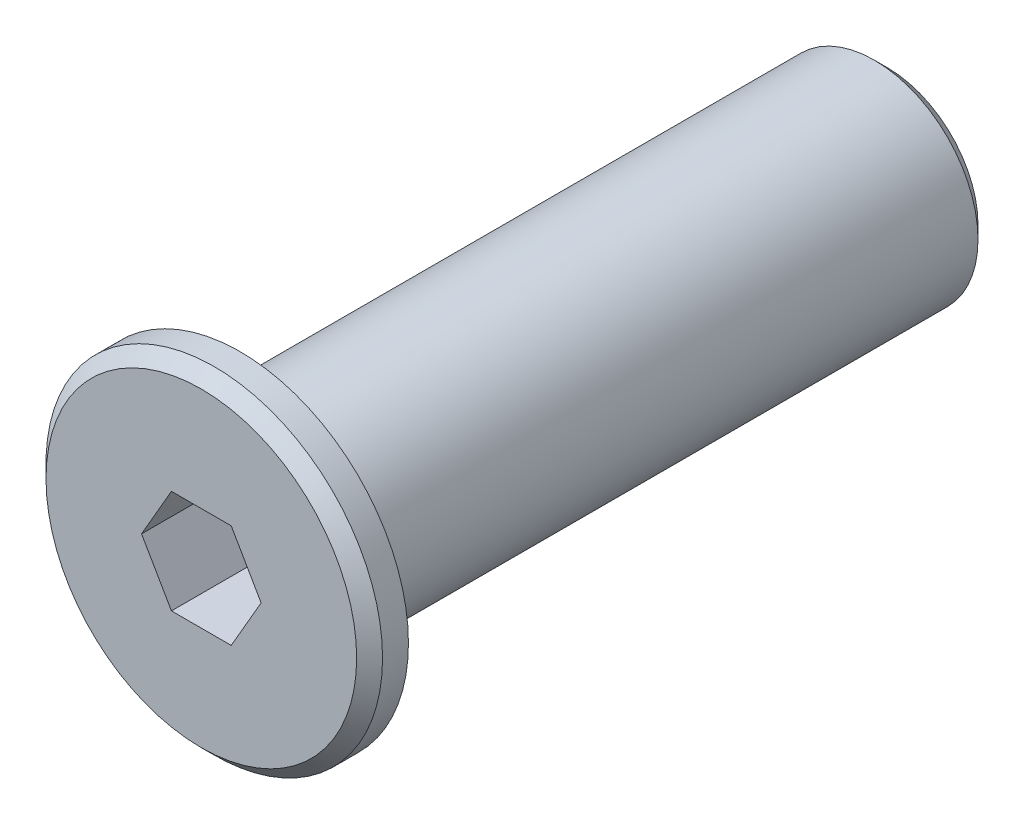
ISO-10303-21;
HEADER;
FILE_DESCRIPTION(('STEP AP214'),'2;1');
FILE_NAME('part.step','',(''),(''),'','','');
FILE_SCHEMA(('AUTOMOTIVE_DESIGN { 1 0 10303 214 1 1 1 1 }'));
ENDSEC;
DATA;
#1=APPLICATION_CONTEXT('core data for automotive mechanical design processes');
#2=APPLICATION_PROTOCOL_DEFINITION('international standard','automotive_design',2000,#1);
#3=PRODUCT_CONTEXT('',#1,'mechanical');
#4=PRODUCT('Part','Part','',(#3));
#5=PRODUCT_RELATED_PRODUCT_CATEGORY('part','',(#4));
#6=PRODUCT_DEFINITION_FORMATION('','',#4);
#7=PRODUCT_DEFINITION_CONTEXT('part definition',#1,'design');
#8=PRODUCT_DEFINITION('design','',#6,#7);
#9=PRODUCT_DEFINITION_SHAPE('','',#8);
#10=(LENGTH_UNIT() NAMED_UNIT(*) SI_UNIT(.MILLI.,.METRE.));
#11=(NAMED_UNIT(*) PLANE_ANGLE_UNIT() SI_UNIT($,.RADIAN.));
#12=(NAMED_UNIT(*) SI_UNIT($,.STERADIAN.) SOLID_ANGLE_UNIT());
#13=UNCERTAINTY_MEASURE_WITH_UNIT(LENGTH_MEASURE(1.E-05),#10,'distance_accuracy_value','');
#14=(GEOMETRIC_REPRESENTATION_CONTEXT(3) GLOBAL_UNCERTAINTY_ASSIGNED_CONTEXT((#13)) GLOBAL_UNIT_ASSIGNED_CONTEXT((#10,
#11,#12)) REPRESENTATION_CONTEXT('',''));
#15=CARTESIAN_POINT('',(0.,0.,0.));
#16=DIRECTION('',(0.,0.,1.));
#17=DIRECTION('',(1.,0.,0.));
#18=AXIS2_PLACEMENT_3D('',#15,#16,#17);
#19=CARTESIAN_POINT('',(0.,0.,-5.));
#20=DIRECTION('',(0.,0.,1.));
#21=DIRECTION('',(1.,0.,0.));
#22=AXIS2_PLACEMENT_3D('',#19,#20,#21);
#23=PLANE('',#22);
#24=DIRECTION('',(-0.499999999999999,0.866025403784439,0.));
#25=VECTOR('',#24,1.);
#26=CARTESIAN_POINT('',(1.73205080756888,1.,-5.));
#27=LINE('',#26,#25);
#28=CARTESIAN_POINT('',(1.73205080756888,1.,-5.));
#29=VERTEX_POINT('',#28);
#30=CARTESIAN_POINT('',(1.15470053837925,2.,-5.));
#31=VERTEX_POINT('',#30);
#32=EDGE_CURVE('E164',#29,#31,#27,.T.);
#33=ORIENTED_EDGE('',*,*,#32,.T.);
#34=DIRECTION('',(1.,0.,0.));
#35=VECTOR('',#34,1.);
#36=CARTESIAN_POINT('',(0.,2.,-5.));
#37=LINE('',#36,#35);
#38=CARTESIAN_POINT('',(0.,2.,-5.));
#39=VERTEX_POINT('',#38);
#40=EDGE_CURVE('E162',#31,#39,#37,.F.);
#41=ORIENTED_EDGE('',*,*,#40,.T.);
#42=CARTESIAN_POINT('',(0.,0.,-5.));
#43=DIRECTION('',(0.,0.,1.));
#44=DIRECTION('',(0.,-1.,0.));
#45=AXIS2_PLACEMENT_3D('',#42,#43,#44);
#46=CIRCLE('',#45,2.);
#47=EDGE_CURVE('E125',#39,#29,#46,.F.);
#48=ORIENTED_EDGE('',*,*,#47,.T.);
#49=EDGE_LOOP('',(#33,#41,#48));
#50=FACE_BOUND('',#49,.T.);
#51=ADVANCED_FACE('F15',(#50),#23,.T.);
#52=CARTESIAN_POINT('',(0.,0.,-5.));
#53=DIRECTION('',(0.,0.,1.));
#54=DIRECTION('',(1.,0.,0.));
#55=AXIS2_PLACEMENT_3D('',#52,#53,#54);
#56=PLANE('',#55);
#57=DIRECTION('',(0.5,0.866025403784439,0.));
#58=VECTOR('',#57,1.);
#59=CARTESIAN_POINT('',(1.73205080756888,-1.,-5.));
#60=LINE('',#59,#58);
#61=CARTESIAN_POINT('',(1.73205080756888,-1.,-5.));
#62=VERTEX_POINT('',#61);
#63=CARTESIAN_POINT('',(2.3094010767585,0.,-5.));
#64=VERTEX_POINT('',#63);
#65=EDGE_CURVE('E54',#62,#64,#60,.T.);
#66=ORIENTED_EDGE('',*,*,#65,.T.);
#67=DIRECTION('',(-0.5,0.866025403784438,0.));
#68=VECTOR('',#67,1.);
#69=CARTESIAN_POINT('',(2.3094010767585,0.,-5.));
#70=LINE('',#69,#68);
#71=EDGE_CURVE('E159',#64,#29,#70,.T.);
#72=ORIENTED_EDGE('',*,*,#71,.T.);
#73=CARTESIAN_POINT('',(0.,0.,-5.));
#74=DIRECTION('',(0.,0.,1.));
#75=DIRECTION('',(0.,-1.,0.));
#76=AXIS2_PLACEMENT_3D('',#73,#74,#75);
#77=CIRCLE('',#76,2.);
#78=EDGE_CURVE('E124',#29,#62,#77,.F.);
#79=ORIENTED_EDGE('',*,*,#78,.T.);
#80=EDGE_LOOP('',(#66,#72,#79));
#81=FACE_BOUND('',#80,.T.);
#82=ADVANCED_FACE('F313',(#81),#56,.T.);
#83=CARTESIAN_POINT('',(0.,0.,-5.));
#84=DIRECTION('',(0.,0.,1.));
#85=DIRECTION('',(1.,0.,0.));
#86=AXIS2_PLACEMENT_3D('',#83,#84,#85);
#87=PLANE('',#86);
#88=DIRECTION('',(0.499999999999999,-0.866025403784439,0.));
#89=VECTOR('',#88,1.);
#90=CARTESIAN_POINT('',(-1.73205080756888,-1.,-5.));
#91=LINE('',#90,#89);
#92=CARTESIAN_POINT('',(-1.73205080756888,-1.,-5.));
#93=VERTEX_POINT('',#92);
#94=CARTESIAN_POINT('',(-1.15470053837925,-2.,-5.));
#95=VERTEX_POINT('',#94);
#96=EDGE_CURVE('E156',#93,#95,#91,.T.);
#97=ORIENTED_EDGE('',*,*,#96,.T.);
#98=DIRECTION('',(1.,0.,0.));
#99=VECTOR('',#98,1.);
#100=CARTESIAN_POINT('',(0.,-2.,-5.));
#101=LINE('',#100,#99);
#102=CARTESIAN_POINT('',(0.,-2.,-5.));
#103=VERTEX_POINT('',#102);
#104=EDGE_CURVE('E154',#95,#103,#101,.T.);
#105=ORIENTED_EDGE('',*,*,#104,.T.);
#106=CARTESIAN_POINT('',(0.,0.,-5.));
#107=DIRECTION('',(0.,0.,1.));
#108=DIRECTION('',(0.,-1.,0.));
#109=AXIS2_PLACEMENT_3D('',#106,#107,#108);
#110=CIRCLE('',#109,2.);
#111=EDGE_CURVE('E121',#103,#93,#110,.F.);
#112=ORIENTED_EDGE('',*,*,#111,.T.);
#113=EDGE_LOOP('',(#97,#105,#112));
#114=FACE_BOUND('',#113,.T.);
#115=ADVANCED_FACE('F308',(#114),#87,.T.);
#116=CARTESIAN_POINT('',(0.,0.,-5.));
#117=DIRECTION('',(0.,0.,1.));
#118=DIRECTION('',(1.,0.,0.));
#119=AXIS2_PLACEMENT_3D('',#116,#117,#118);
#120=PLANE('',#119);
#121=DIRECTION('',(-0.5,-0.866025403784438,0.));
#122=VECTOR('',#121,1.);
#123=CARTESIAN_POINT('',(-1.73205080756888,1.,-5.));
#124=LINE('',#123,#122);
#125=CARTESIAN_POINT('',(-1.73205080756888,1.,-5.));
#126=VERTEX_POINT('',#125);
#127=CARTESIAN_POINT('',(-2.3094010767585,0.,-5.));
#128=VERTEX_POINT('',#127);
#129=EDGE_CURVE('E151',#126,#128,#124,.T.);
#130=ORIENTED_EDGE('',*,*,#129,.T.);
#131=DIRECTION('',(0.5,-0.866025403784438,0.));
#132=VECTOR('',#131,1.);
#133=CARTESIAN_POINT('',(-2.3094010767585,0.,-5.));
#134=LINE('',#133,#132);
#135=EDGE_CURVE('E139',#128,#93,#134,.T.);
#136=ORIENTED_EDGE('',*,*,#135,.T.);
#137=CARTESIAN_POINT('',(0.,0.,-5.));
#138=DIRECTION('',(0.,0.,1.));
#139=DIRECTION('',(0.,-1.,0.));
#140=AXIS2_PLACEMENT_3D('',#137,#138,#139);
#141=CIRCLE('',#140,2.);
#142=EDGE_CURVE('E116',#93,#126,#141,.F.);
#143=ORIENTED_EDGE('',*,*,#142,.T.);
#144=EDGE_LOOP('',(#130,#136,#143));
#145=FACE_BOUND('',#144,.T.);
#146=ADVANCED_FACE('F306',(#145),#120,.T.);
#147=CARTESIAN_POINT('',(0.,0.,-5.));
#148=DIRECTION('',(0.,0.,1.));
#149=DIRECTION('',(1.,0.,0.));
#150=AXIS2_PLACEMENT_3D('',#147,#148,#149);
#151=PLANE('',#150);
#152=DIRECTION('',(1.,0.,0.));
#153=VECTOR('',#152,1.);
#154=CARTESIAN_POINT('',(0.,2.,-5.));
#155=LINE('',#154,#153);
#156=CARTESIAN_POINT('',(-1.15470053837925,2.,-5.));
#157=VERTEX_POINT('',#156);
#158=EDGE_CURVE('E134',#39,#157,#155,.F.);
#159=ORIENTED_EDGE('',*,*,#158,.T.);
#160=DIRECTION('',(-0.5,-0.866025403784439,0.));
#161=VECTOR('',#160,1.);
#162=CARTESIAN_POINT('',(-1.15470053837925,2.,-5.));
#163=LINE('',#162,#161);
#164=EDGE_CURVE('E127',#157,#126,#163,.T.);
#165=ORIENTED_EDGE('',*,*,#164,.T.);
#166=CARTESIAN_POINT('',(0.,0.,-5.));
#167=DIRECTION('',(0.,0.,1.));
#168=DIRECTION('',(0.,-1.,0.));
#169=AXIS2_PLACEMENT_3D('',#166,#167,#168);
#170=CIRCLE('',#169,2.);
#171=EDGE_CURVE('E113',#126,#39,#170,.F.);
#172=ORIENTED_EDGE('',*,*,#171,.T.);
#173=EDGE_LOOP('',(#159,#165,#172));
#174=FACE_BOUND('',#173,.T.);
#175=ADVANCED_FACE('F287',(#174),#151,.T.);
#176=CARTESIAN_POINT('',(0.,0.250000000000001,-6.5));
#177=DIRECTION('',(0.,0.,-1.));
#178=DIRECTION('',(-1.,0.,0.));
#179=AXIS2_PLACEMENT_3D('',#176,#177,#178);
#180=PLANE('',#179);
#181=CARTESIAN_POINT('',(0.,0.,-6.5));
#182=DIRECTION('',(0.,0.,1.));
#183=DIRECTION('',(0.,-1.,0.));
#184=AXIS2_PLACEMENT_3D('',#181,#182,#183);
#185=CIRCLE('',#184,0.500000000000001);
#186=CARTESIAN_POINT('',(0.,0.500000000000001,-6.5));
#187=VERTEX_POINT('',#186);
#188=EDGE_CURVE('E60',#187,#187,#185,.T.);
#189=ORIENTED_EDGE('',*,*,#188,.T.);
#190=EDGE_LOOP('',(#189));
#191=FACE_BOUND('',#190,.T.);
#192=ADVANCED_FACE('F271',(#191),#180,.F.);
#193=CARTESIAN_POINT('',(0.,2.,-5.));
#194=CARTESIAN_POINT('',(0.,1.47070709916903,-6.19091513246404));
#195=CARTESIAN_POINT('',(0.,0.500000000000001,-6.5));
#196=(BOUNDED_CURVE() B_SPLINE_CURVE(2,(#193,#194,#195),.UNSPECIFIED.,.F.,
.F.) B_SPLINE_CURVE_WITH_KNOTS((3,3),(0.,0.459388320020566),
.UNSPECIFIED.) CURVE() GEOMETRIC_REPRESENTATION_ITEM() RATIONAL_B_SPLINE_CURVE((1.,1.,1.)) REPRESENTATION_ITEM(''));
#197=CARTESIAN_POINT('',(0.,0.,-6.5));
#198=DIRECTION('',(0.,0.,1.));
#199=AXIS1_PLACEMENT('',#197,#198);
#200=SURFACE_OF_REVOLUTION('',#196,#199);
#201=ORIENTED_EDGE('',*,*,#188,.F.);
#202=CARTESIAN_POINT('',(0.,2.,-5.));
#203=CARTESIAN_POINT('',(0.,1.97827182619173,-5.04888240871449));
#204=CARTESIAN_POINT('',(0.,1.95566558006333,-5.09738320406536));
#205=CARTESIAN_POINT('',(0.,1.90924750218105,-5.19205941996444));
#206=CARTESIAN_POINT('',(0.,1.88548984352403,-5.23826144832604));
#207=CARTESIAN_POINT('',(0.,1.83677019123873,-5.32834337707176));
#208=CARTESIAN_POINT('',(0.,1.81186145011461,-5.3722519744186));
#209=CARTESIAN_POINT('',(0.,1.76084050483905,-5.45774340043139));
#210=CARTESIAN_POINT('',(0.,1.73477996335951,-5.49935699073731));
#211=CARTESIAN_POINT('',(0.,1.6814572947538,-5.58025681634127));
#212=CARTESIAN_POINT('',(0.,1.65424445703679,-5.61957545842493));
#213=CARTESIAN_POINT('',(0.,1.59861983381496,-5.69588374907246));
#214=CARTESIAN_POINT('',(0.,1.57025413740641,-5.73290691641974));
#215=CARTESIAN_POINT('',(0.,1.51232729538913,-5.80462334879223));
#216=CARTESIAN_POINT('',(0.,1.48280819753971,-5.83935050128348));
#217=CARTESIAN_POINT('',(0.,1.42257900760656,-5.90647470967855));
#218=CARTESIAN_POINT('',(0.,1.39190612070068,-5.93890508238314));
#219=CARTESIAN_POINT('',(0.,1.32937429317669,-6.00143673695821));
#220=CARTESIAN_POINT('',(0.,1.29754703010189,-6.03156963172105));
#221=CARTESIAN_POINT('',(0.,1.23271325795719,-6.08950782814783));
#222=CARTESIAN_POINT('',(0.,1.1997323684979,-6.11734177070918));
#223=CARTESIAN_POINT('',(0.,1.13259429865741,-6.17068740496834));
#224=CARTESIAN_POINT('',(0.,1.09845647742931,-6.19622336773438));
#225=CARTESIAN_POINT('',(0.,1.0462714232118,-6.23286121671812));
#226=CARTESIAN_POINT('',(0.,1.02877692942351,-6.24475698448814));
#227=CARTESIAN_POINT('',(0.,0.993498546966384,-6.26797271454702));
#228=CARTESIAN_POINT('',(0.,0.975715914658029,-6.2792945811534));
#229=CARTESIAN_POINT('',(0.,0.939862259026094,-6.30136231719819));
#230=CARTESIAN_POINT('',(0.,0.921792130786073,-6.31210964156172));
#231=CARTESIAN_POINT('',(0.,0.885363675176823,-6.33302891879935));
#232=CARTESIAN_POINT('',(0.,0.867005905754607,-6.34320184299462));
#233=CARTESIAN_POINT('',(0.,0.830002547961604,-6.36297276652363));
#234=CARTESIAN_POINT('',(0.,0.811357206016257,-6.37257122706531));
#235=CARTESIAN_POINT('',(0.,0.773778999499796,-6.3911937540134));
#236=CARTESIAN_POINT('',(0.,0.754846099952507,-6.40021774984228));
#237=CARTESIAN_POINT('',(0.,0.716693057730008,-6.41769187140308));
#238=CARTESIAN_POINT('',(0.,0.697472632008254,-6.4261413790729));
#239=CARTESIAN_POINT('',(0.,0.658744780295542,-6.44246710936987));
#240=CARTESIAN_POINT('',(0.,0.639236859070804,-6.45034215707015));
#241=CARTESIAN_POINT('',(0.,0.599934216251847,-6.46551939673935));
#242=CARTESIAN_POINT('',(0.,0.580138824832327,-6.47281985347101));
#243=CARTESIAN_POINT('',(0.,0.540261429737367,-6.48684894907975));
#244=CARTESIAN_POINT('',(0.,0.520178620235151,-6.49357529786835));
#245=CARTESIAN_POINT('',(0.,0.500000000000001,-6.5));
#246=B_SPLINE_CURVE_WITH_KNOTS('',3,(#202,#203,#204,#205,#206,#207,#208,#209,#210,#211,#212,
#213,#214,#215,#216,#217,#218,#219,#220,#221,#222,#223,#224,#225,#226,#227,#228,#229,#230,#231,
#232,#233,#234,#235,#236,#237,#238,#239,#240,#241,#242,#243,#244,#245),.UNSPECIFIED.,.F.,.F.,(4,
2,2,2,2,2,2,2,2,2,2,2,2,2,2,2,2,2,2,2,2,4),(0.,0.160484874729874,0.31630299090354,
0.467702744837059,0.614954894249969,0.758353692622503,0.898217716213365,1.03489026161929,
1.16873918426277,1.3001560529299,1.4295545169861,1.55736782412704,1.62082716949787,
1.68405992592196,1.74712412987997,1.81007828401216,1.87298119801393,1.93589182528073,
1.99886909754671,2.06197175982651,2.12525820795964,2.1887863309729),.UNSPECIFIED.);
#247=EDGE_CURVE('E110',#39,#187,#246,.T.);
#248=ORIENTED_EDGE('',*,*,#247,.F.);
#249=ORIENTED_EDGE('',*,*,#171,.F.);
#250=ORIENTED_EDGE('',*,*,#142,.F.);
#251=ORIENTED_EDGE('',*,*,#111,.F.);
#252=CARTESIAN_POINT('',(0.,0.,-5.));
#253=DIRECTION('',(0.,0.,1.));
#254=DIRECTION('',(0.,-1.,0.));
#255=AXIS2_PLACEMENT_3D('',#252,#253,#254);
#256=CIRCLE('',#255,2.);
#257=EDGE_CURVE('E105',#62,#103,#256,.F.);
#258=ORIENTED_EDGE('',*,*,#257,.F.);
#259=ORIENTED_EDGE('',*,*,#78,.F.);
#260=ORIENTED_EDGE('',*,*,#47,.F.);
#261=ORIENTED_EDGE('',*,*,#247,.T.);
#262=EDGE_LOOP('',(#201,#248,#249,#250,#251,#258,#259,#260,#261));
#263=FACE_BOUND('',#262,.T.);
#264=ADVANCED_FACE('F265',(#263),#200,.T.);
#265=CARTESIAN_POINT('',(0.,0.,-5.));
#266=DIRECTION('',(0.,0.,1.));
#267=DIRECTION('',(1.,0.,0.));
#268=AXIS2_PLACEMENT_3D('',#265,#266,#267);
#269=PLANE('',#268);
#270=DIRECTION('',(1.,0.,0.));
#271=VECTOR('',#270,1.);
#272=CARTESIAN_POINT('',(-1.15470053837925,-2.,-5.));
#273=LINE('',#272,#271);
#274=CARTESIAN_POINT('',(1.15470053837925,-2.,-5.));
#275=VERTEX_POINT('',#274);
#276=EDGE_CURVE('E180',#103,#275,#273,.T.);
#277=ORIENTED_EDGE('',*,*,#276,.T.);
#278=DIRECTION('',(0.5,0.866025403784439,0.));
#279=VECTOR('',#278,1.);
#280=CARTESIAN_POINT('',(1.15470053837925,-2.,-5.));
#281=LINE('',#280,#279);
#282=EDGE_CURVE('E108',#275,#62,#281,.T.);
#283=ORIENTED_EDGE('',*,*,#282,.T.);
#284=ORIENTED_EDGE('',*,*,#257,.T.);
#285=EDGE_LOOP('',(#277,#283,#284));
#286=FACE_BOUND('',#285,.T.);
#287=ADVANCED_FACE('F270',(#286),#269,.T.);
#288=CARTESIAN_POINT('',(-2.3094010767585,0.,0.));
#289=DIRECTION('',(-0.866025403784439,-0.5,0.));
#290=DIRECTION('',(0.5,-0.866025403784439,0.));
#291=AXIS2_PLACEMENT_3D('',#288,#289,#290);
#292=PLANE('',#291);
#293=DIRECTION('',(0.,0.,1.));
#294=VECTOR('',#293,1.);
#295=CARTESIAN_POINT('',(-2.3094010767585,0.,0.));
#296=LINE('',#295,#294);
#297=CARTESIAN_POINT('',(-2.3094010767585,0.,0.));
#298=VERTEX_POINT('',#297);
#299=EDGE_CURVE('E172',#128,#298,#296,.T.);
#300=ORIENTED_EDGE('',*,*,#299,.T.);
#301=DIRECTION('',(0.5,-0.866025403784439,0.));
#302=VECTOR('',#301,1.);
#303=CARTESIAN_POINT('',(-2.3094010767585,0.,0.));
#304=LINE('',#303,#302);
#305=CARTESIAN_POINT('',(-1.15470053837925,-2.,0.));
#306=VERTEX_POINT('',#305);
#307=EDGE_CURVE('E171',#298,#306,#304,.T.);
#308=ORIENTED_EDGE('',*,*,#307,.T.);
#309=DIRECTION('',(0.,0.,-1.));
#310=VECTOR('',#309,1.);
#311=CARTESIAN_POINT('',(-1.15470053837925,-2.,0.));
#312=LINE('',#311,#310);
#313=EDGE_CURVE('E176',#306,#95,#312,.T.);
#314=ORIENTED_EDGE('',*,*,#313,.T.);
#315=ORIENTED_EDGE('',*,*,#96,.F.);
#316=ORIENTED_EDGE('',*,*,#135,.F.);
#317=EDGE_LOOP('',(#300,#308,#314,#315,#316));
#318=FACE_BOUND('',#317,.T.);
#319=ADVANCED_FACE('F228',(#318),#292,.F.);
#320=CARTESIAN_POINT('',(-1.15470053837925,-2.,0.));
#321=DIRECTION('',(0.,-1.,0.));
#322=DIRECTION('',(0.,0.,-1.));
#323=AXIS2_PLACEMENT_3D('',#320,#321,#322);
#324=PLANE('',#323);
#325=ORIENTED_EDGE('',*,*,#313,.F.);
#326=DIRECTION('',(-1.,0.,0.));
#327=VECTOR('',#326,1.);
#328=CARTESIAN_POINT('',(0.,-2.,0.));
#329=LINE('',#328,#327);
#330=CARTESIAN_POINT('',(1.15470053837925,-2.,0.));
#331=VERTEX_POINT('',#330);
#332=EDGE_CURVE('E234',#306,#331,#329,.F.);
#333=ORIENTED_EDGE('',*,*,#332,.T.);
#334=DIRECTION('',(0.,0.,1.));
#335=VECTOR('',#334,1.);
#336=CARTESIAN_POINT('',(1.15470053837925,-2.,0.));
#337=LINE('',#336,#335);
#338=EDGE_CURVE('E179',#331,#275,#337,.F.);
#339=ORIENTED_EDGE('',*,*,#338,.T.);
#340=ORIENTED_EDGE('',*,*,#276,.F.);
#341=ORIENTED_EDGE('',*,*,#104,.F.);
#342=EDGE_LOOP('',(#325,#333,#339,#340,#341));
#343=FACE_BOUND('',#342,.T.);
#344=ADVANCED_FACE('F237',(#343),#324,.F.);
#345=CARTESIAN_POINT('',(1.15470053837925,-2.,0.));
#346=DIRECTION('',(0.866025403784439,-0.5,0.));
#347=DIRECTION('',(0.5,0.866025403784439,0.));
#348=AXIS2_PLACEMENT_3D('',#345,#346,#347);
#349=PLANE('',#348);
#350=ORIENTED_EDGE('',*,*,#338,.F.);
#351=DIRECTION('',(0.5,0.866025403784439,0.));
#352=VECTOR('',#351,1.);
#353=CARTESIAN_POINT('',(1.15470053837925,-2.,0.));
#354=LINE('',#353,#352);
#355=CARTESIAN_POINT('',(2.3094010767585,0.,0.));
#356=VERTEX_POINT('',#355);
#357=EDGE_CURVE('E245',#331,#356,#354,.T.);
#358=ORIENTED_EDGE('',*,*,#357,.T.);
#359=DIRECTION('',(0.,0.,1.));
#360=VECTOR('',#359,1.);
#361=CARTESIAN_POINT('',(2.3094010767585,0.,0.));
#362=LINE('',#361,#360);
#363=EDGE_CURVE('E181',#356,#64,#362,.F.);
#364=ORIENTED_EDGE('',*,*,#363,.T.);
#365=ORIENTED_EDGE('',*,*,#65,.F.);
#366=ORIENTED_EDGE('',*,*,#282,.F.);
#367=EDGE_LOOP('',(#350,#358,#364,#365,#366));
#368=FACE_BOUND('',#367,.T.);
#369=ADVANCED_FACE('F311',(#368),#349,.F.);
#370=CARTESIAN_POINT('',(2.3094010767585,0.,0.));
#371=DIRECTION('',(0.866025403784439,0.5,0.));
#372=DIRECTION('',(-0.5,0.866025403784439,0.));
#373=AXIS2_PLACEMENT_3D('',#370,#371,#372);
#374=PLANE('',#373);
#375=ORIENTED_EDGE('',*,*,#363,.F.);
#376=DIRECTION('',(-0.5,0.866025403784439,0.));
#377=VECTOR('',#376,1.);
#378=CARTESIAN_POINT('',(2.3094010767585,0.,0.));
#379=LINE('',#378,#377);
#380=CARTESIAN_POINT('',(1.15470053837925,2.,0.));
#381=VERTEX_POINT('',#380);
#382=EDGE_CURVE('E247',#356,#381,#379,.T.);
#383=ORIENTED_EDGE('',*,*,#382,.T.);
#384=DIRECTION('',(0.,0.,1.));
#385=VECTOR('',#384,1.);
#386=CARTESIAN_POINT('',(1.15470053837925,2.,0.));
#387=LINE('',#386,#385);
#388=EDGE_CURVE('E175',#381,#31,#387,.F.);
#389=ORIENTED_EDGE('',*,*,#388,.T.);
#390=ORIENTED_EDGE('',*,*,#32,.F.);
#391=ORIENTED_EDGE('',*,*,#71,.F.);
#392=EDGE_LOOP('',(#375,#383,#389,#390,#391));
#393=FACE_BOUND('',#392,.T.);
#394=ADVANCED_FACE('F295',(#393),#374,.F.);
#395=CARTESIAN_POINT('',(1.15470053837925,2.,0.));
#396=DIRECTION('',(0.,1.,0.));
#397=DIRECTION('',(0.,0.,1.));
#398=AXIS2_PLACEMENT_3D('',#395,#396,#397);
#399=PLANE('',#398);
#400=ORIENTED_EDGE('',*,*,#388,.F.);
#401=DIRECTION('',(-1.,0.,0.));
#402=VECTOR('',#401,1.);
#403=CARTESIAN_POINT('',(0.,2.,0.));
#404=LINE('',#403,#402);
#405=CARTESIAN_POINT('',(-1.15470053837925,2.,0.));
#406=VERTEX_POINT('',#405);
#407=EDGE_CURVE('E296',#381,#406,#404,.T.);
#408=ORIENTED_EDGE('',*,*,#407,.T.);
#409=DIRECTION('',(0.,0.,1.));
#410=VECTOR('',#409,1.);
#411=CARTESIAN_POINT('',(-1.15470053837925,2.,0.));
#412=LINE('',#411,#410);
#413=EDGE_CURVE('E168',#406,#157,#412,.F.);
#414=ORIENTED_EDGE('',*,*,#413,.T.);
#415=ORIENTED_EDGE('',*,*,#158,.F.);
#416=ORIENTED_EDGE('',*,*,#40,.F.);
#417=EDGE_LOOP('',(#400,#408,#414,#415,#416));
#418=FACE_BOUND('',#417,.T.);
#419=ADVANCED_FACE('F290',(#418),#399,.F.);
#420=CARTESIAN_POINT('',(-1.15470053837925,2.,0.));
#421=DIRECTION('',(-0.866025403784439,0.5,0.));
#422=DIRECTION('',(-0.5,-0.866025403784439,0.));
#423=AXIS2_PLACEMENT_3D('',#420,#421,#422);
#424=PLANE('',#423);
#425=ORIENTED_EDGE('',*,*,#413,.F.);
#426=DIRECTION('',(-0.5,-0.866025403784439,0.));
#427=VECTOR('',#426,1.);
#428=CARTESIAN_POINT('',(-1.15470053837925,2.,0.));
#429=LINE('',#428,#427);
#430=EDGE_CURVE('E104',#406,#298,#429,.T.);
#431=ORIENTED_EDGE('',*,*,#430,.T.);
#432=ORIENTED_EDGE('',*,*,#299,.F.);
#433=ORIENTED_EDGE('',*,*,#129,.F.);
#434=ORIENTED_EDGE('',*,*,#164,.F.);
#435=EDGE_LOOP('',(#425,#431,#432,#433,#434));
#436=FACE_BOUND('',#435,.T.);
#437=ADVANCED_FACE('F304',(#436),#424,.F.);
#438=CARTESIAN_POINT('',(0.,0.,0.));
#439=DIRECTION('',(0.,0.,-1.));
#440=DIRECTION('',(-1.,0.,0.));
#441=AXIS2_PLACEMENT_3D('',#438,#439,#440);
#442=PLANE('',#441);
#443=ORIENTED_EDGE('',*,*,#407,.F.);
#444=ORIENTED_EDGE('',*,*,#382,.F.);
#445=ORIENTED_EDGE('',*,*,#357,.F.);
#446=ORIENTED_EDGE('',*,*,#332,.F.);
#447=ORIENTED_EDGE('',*,*,#307,.F.);
#448=ORIENTED_EDGE('',*,*,#430,.F.);
#449=EDGE_LOOP('',(#443,#444,#445,#446,#447,#448));
#450=FACE_BOUND('',#449,.T.);
#451=CARTESIAN_POINT('',(0.,0.,2.27373675443232E-10));
#452=DIRECTION('',(0.,0.,-1.));
#453=DIRECTION('',(-1.,0.,0.));
#454=AXIS2_PLACEMENT_3D('',#451,#452,#453);
#455=CIRCLE('',#454,6.00000000025602);
#456=CARTESIAN_POINT('',(6.00000000025602,0.,2.27373675443232E-10));
#457=VERTEX_POINT('',#456);
#458=EDGE_CURVE('E31',#457,#457,#455,.T.);
#459=ORIENTED_EDGE('',*,*,#458,.F.);
#460=EDGE_LOOP('',(#459));
#461=FACE_BOUND('',#460,.T.);
#462=ADVANCED_FACE('F243',(#450,#461),#442,.F.);
#463=CARTESIAN_POINT('',(0.,0.,-0.50000000021555));
#464=DIRECTION('',(0.,0.,-1.));
#465=DIRECTION('',(-1.,0.,0.));
#466=AXIS2_PLACEMENT_3D('',#463,#464,#465);
#467=CONICAL_SURFACE('',#466,6.49999999978945,0.785398162487954);
#468=CARTESIAN_POINT('',(0.,0.,-0.5));
#469=DIRECTION('',(0.,0.,-1.));
#470=DIRECTION('',(-1.,0.,0.));
#471=AXIS2_PLACEMENT_3D('',#468,#469,#470);
#472=CIRCLE('',#471,6.5);
#473=CARTESIAN_POINT('',(6.49999999989473,0.,-0.500000000107775));
#474=VERTEX_POINT('',#473);
#475=EDGE_CURVE('E96',#474,#474,#472,.T.);
#476=ORIENTED_EDGE('',*,*,#475,.F.);
#477=EDGE_LOOP('',(#476));
#478=FACE_BOUND('',#477,.T.);
#479=ORIENTED_EDGE('',*,*,#458,.T.);
#480=EDGE_LOOP('',(#479));
#481=FACE_BOUND('',#480,.T.);
#482=ADVANCED_FACE('F381',(#478,#481),#467,.T.);
#483=CARTESIAN_POINT('',(0.,0.,0.));
#484=DIRECTION('',(0.,0.,-1.));
#485=DIRECTION('',(-1.,0.,0.));
#486=AXIS2_PLACEMENT_3D('',#483,#484,#485);
#487=CYLINDRICAL_SURFACE('',#486,6.5);
#488=ORIENTED_EDGE('',*,*,#475,.T.);
#489=EDGE_LOOP('',(#488));
#490=FACE_BOUND('',#489,.T.);
#491=CARTESIAN_POINT('',(0.,0.,-1.5));
#492=DIRECTION('',(0.,0.,-1.));
#493=DIRECTION('',(-1.,0.,0.));
#494=AXIS2_PLACEMENT_3D('',#491,#492,#493);
#495=CIRCLE('',#494,6.5);
#496=CARTESIAN_POINT('',(6.5,0.,-1.5));
#497=VERTEX_POINT('',#496);
#498=EDGE_CURVE('E93',#497,#497,#495,.T.);
#499=ORIENTED_EDGE('',*,*,#498,.F.);
#500=EDGE_LOOP('',(#499));
#501=FACE_BOUND('',#500,.T.);
#502=ADVANCED_FACE('F94',(#490,#501),#487,.T.);
#503=CARTESIAN_POINT('',(0.,0.,-26.5));
#504=DIRECTION('',(0.,0.,1.));
#505=DIRECTION('',(1.,0.,0.));
#506=AXIS2_PLACEMENT_3D('',#503,#504,#505);
#507=PLANE('',#506);
#508=CARTESIAN_POINT('',(0.,0.,-26.500000000226));
#509=DIRECTION('',(0.,0.,1.));
#510=DIRECTION('',(1.,0.,0.));
#511=AXIS2_PLACEMENT_3D('',#508,#509,#510);
#512=CIRCLE('',#511,3.5000000002583);
#513=CARTESIAN_POINT('',(-3.5000000002583,0.,-26.500000000226));
#514=VERTEX_POINT('',#513);
#515=EDGE_CURVE('E89',#514,#514,#512,.T.);
#516=ORIENTED_EDGE('',*,*,#515,.F.);
#517=EDGE_LOOP('',(#516));
#518=FACE_BOUND('',#517,.T.);
#519=ADVANCED_FACE('F191',(#518),#507,.F.);
#520=CARTESIAN_POINT('',(0.,0.,-1.5));
#521=DIRECTION('',(0.,0.,-1.));
#522=DIRECTION('',(-1.,0.,0.));
#523=AXIS2_PLACEMENT_3D('',#520,#521,#522);
#524=PLANE('',#523);
#525=CARTESIAN_POINT('',(0.,0.,-1.5));
#526=DIRECTION('',(0.,0.,-1.));
#527=DIRECTION('',(-1.,0.,0.));
#528=AXIS2_PLACEMENT_3D('',#525,#526,#527);
#529=CIRCLE('',#528,4.);
#530=CARTESIAN_POINT('',(-4.,0.,-1.5));
#531=VERTEX_POINT('',#530);
#532=EDGE_CURVE('E24',#531,#531,#529,.T.);
#533=ORIENTED_EDGE('',*,*,#532,.F.);
#534=EDGE_LOOP('',(#533));
#535=FACE_BOUND('',#534,.T.);
#536=ORIENTED_EDGE('',*,*,#498,.T.);
#537=EDGE_LOOP('',(#536));
#538=FACE_BOUND('',#537,.T.);
#539=ADVANCED_FACE('F188',(#535,#538),#524,.T.);
#540=CARTESIAN_POINT('',(0.,0.,-25.9999999998399));
#541=DIRECTION('',(0.,0.,1.));
#542=DIRECTION('',(1.,0.,0.));
#543=AXIS2_PLACEMENT_3D('',#540,#541,#542);
#544=CONICAL_SURFACE('',#543,3.99999999973488,0.785398162487954);
#545=CARTESIAN_POINT('',(0.,0.,-26.));
#546=DIRECTION('',(0.,0.,-1.));
#547=DIRECTION('',(-1.,0.,0.));
#548=AXIS2_PLACEMENT_3D('',#545,#546,#547);
#549=CIRCLE('',#548,4.);
#550=CARTESIAN_POINT('',(-3.99999999989586,0.,-25.9999999998915));
#551=VERTEX_POINT('',#550);
#552=EDGE_CURVE('E9',#551,#551,#549,.F.);
#553=ORIENTED_EDGE('',*,*,#552,.F.);
#554=EDGE_LOOP('',(#553));
#555=FACE_BOUND('',#554,.T.);
#556=ORIENTED_EDGE('',*,*,#515,.T.);
#557=EDGE_LOOP('',(#556));
#558=FACE_BOUND('',#557,.T.);
#559=ADVANCED_FACE('F190',(#555,#558),#544,.T.);
#560=CARTESIAN_POINT('',(0.,0.,-1.5));
#561=DIRECTION('',(0.,0.,-1.));
#562=DIRECTION('',(-1.,0.,0.));
#563=AXIS2_PLACEMENT_3D('',#560,#561,#562);
#564=CYLINDRICAL_SURFACE('',#563,4.);
#565=ORIENTED_EDGE('',*,*,#552,.T.);
#566=EDGE_LOOP('',(#565));
#567=FACE_BOUND('',#566,.T.);
#568=ORIENTED_EDGE('',*,*,#532,.T.);
#569=EDGE_LOOP('',(#568));
#570=FACE_BOUND('',#569,.T.);
#571=ADVANCED_FACE('F186',(#567,#570),#564,.T.);
#572=CLOSED_SHELL('',(#51,#82,#115,#146,#175,#192,#264,#287,#319,#344,#369,#394,#419,#437,#462,
#482,#502,#519,#539,#559,#571));
#573=MANIFOLD_SOLID_BREP('B1',#572);
#574=ADVANCED_BREP_SHAPE_REPRESENTATION('',(#18,#573),#14);
#575=SHAPE_DEFINITION_REPRESENTATION(#9,#574);
ENDSEC;
END-ISO-10303-21;
